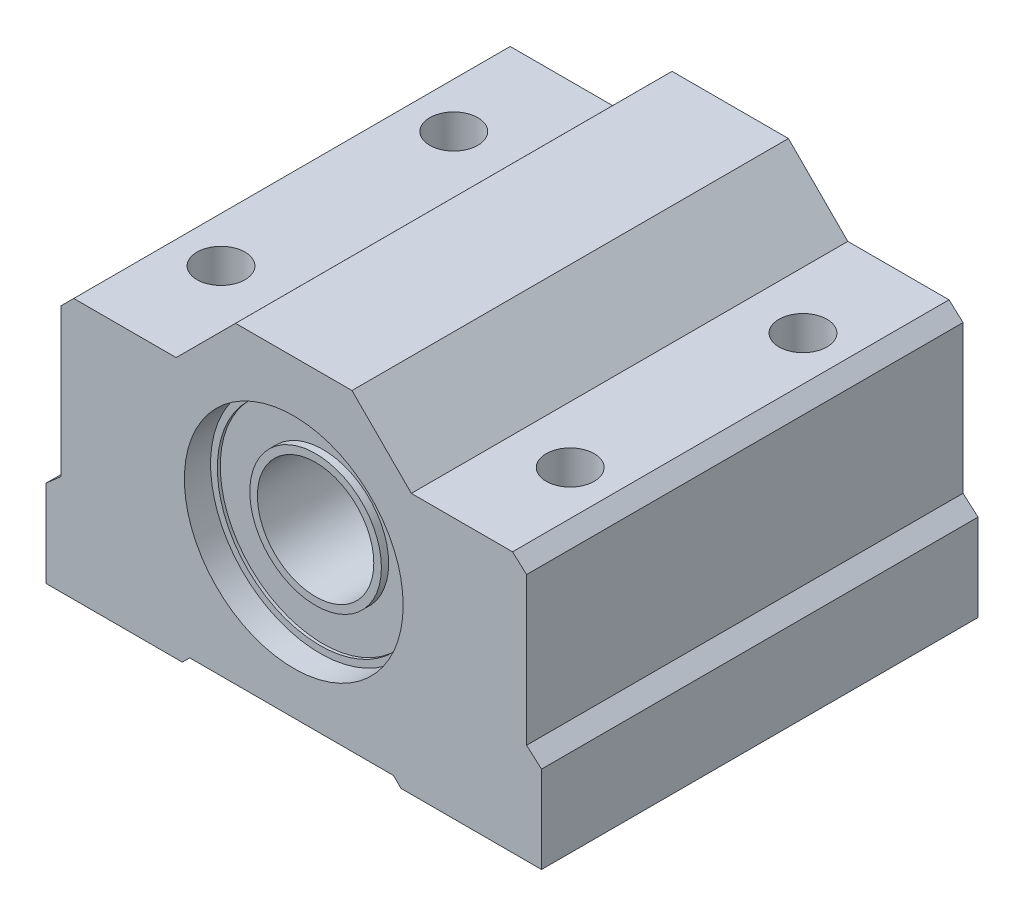
ISO-10303-21;
HEADER;
FILE_DESCRIPTION(('STEP AP214'),'2;1');
FILE_NAME('part.step','',(''),(''),'','','');
FILE_SCHEMA(('AUTOMOTIVE_DESIGN { 1 0 10303 214 1 1 1 1 }'));
ENDSEC;
DATA;
#1=APPLICATION_CONTEXT('core data for automotive mechanical design processes');
#2=APPLICATION_PROTOCOL_DEFINITION('international standard','automotive_design',2000,#1);
#3=PRODUCT_CONTEXT('',#1,'mechanical');
#4=PRODUCT('Part','Part','',(#3));
#5=PRODUCT_RELATED_PRODUCT_CATEGORY('part','',(#4));
#6=PRODUCT_DEFINITION_FORMATION('','',#4);
#7=PRODUCT_DEFINITION_CONTEXT('part definition',#1,'design');
#8=PRODUCT_DEFINITION('design','',#6,#7);
#9=PRODUCT_DEFINITION_SHAPE('','',#8);
#10=(LENGTH_UNIT() NAMED_UNIT(*) SI_UNIT(.MILLI.,.METRE.));
#11=(NAMED_UNIT(*) PLANE_ANGLE_UNIT() SI_UNIT($,.RADIAN.));
#12=(NAMED_UNIT(*) SI_UNIT($,.STERADIAN.) SOLID_ANGLE_UNIT());
#13=UNCERTAINTY_MEASURE_WITH_UNIT(LENGTH_MEASURE(1.E-05),#10,'distance_accuracy_value','');
#14=(GEOMETRIC_REPRESENTATION_CONTEXT(3) GLOBAL_UNCERTAINTY_ASSIGNED_CONTEXT((#13)) GLOBAL_UNIT_ASSIGNED_CONTEXT((#10,
#11,#12)) REPRESENTATION_CONTEXT('',''));
#15=CARTESIAN_POINT('',(0.,0.,0.));
#16=DIRECTION('',(0.,0.,1.));
#17=DIRECTION('',(1.,0.,0.));
#18=AXIS2_PLACEMENT_3D('',#15,#16,#17);
#19=CARTESIAN_POINT('',(0.,0.,-30.));
#20=DIRECTION('',(0.,0.,1.));
#21=DIRECTION('',(1.,0.,0.));
#22=AXIS2_PLACEMENT_3D('',#19,#20,#21);
#23=PLANE('',#22);
#24=DIRECTION('',(-0.748408560935745,-0.663237985882961,0.));
#25=VECTOR('',#24,1.);
#26=CARTESIAN_POINT('',(-5.00715940899254,5.65016034579369,-30.));
#27=LINE('',#26,#25);
#28=CARTESIAN_POINT('',(-15.9972160814821,-4.08920319527542,-30.));
#29=VERTEX_POINT('',#28);
#30=CARTESIAN_POINT('',(-17.03,-5.00445398438139,-30.));
#31=VERTEX_POINT('',#30);
#32=EDGE_CURVE('E253',#29,#31,#27,.T.);
#33=ORIENTED_EDGE('',*,*,#32,.F.);
#34=DIRECTION('',(0.,-1.,0.));
#35=VECTOR('',#34,1.);
#36=CARTESIAN_POINT('',(-15.9972160814821,0.,-30.));
#37=LINE('',#36,#35);
#38=CARTESIAN_POINT('',(-15.9972160814821,6.07141612040069,-30.));
#39=VERTEX_POINT('',#38);
#40=EDGE_CURVE('E191',#39,#29,#37,.T.);
#41=ORIENTED_EDGE('',*,*,#40,.F.);
#42=DIRECTION('',(-0.707106781186547,-0.707106781186548,0.));
#43=VECTOR('',#42,1.);
#44=CARTESIAN_POINT('',(-11.0343161009414,11.0343161009414,-30.));
#45=LINE('',#44,#43);
#46=CARTESIAN_POINT('',(-15.1243670871386,6.94426511474419,-30.));
#47=VERTEX_POINT('',#46);
#48=EDGE_CURVE('E176',#47,#39,#45,.T.);
#49=ORIENTED_EDGE('',*,*,#48,.F.);
#50=DIRECTION('',(-1.,0.,0.));
#51=VECTOR('',#50,1.);
#52=CARTESIAN_POINT('',(0.,6.9442651147442,-30.));
#53=LINE('',#52,#51);
#54=CARTESIAN_POINT('',(-8.083891516657,6.94426511474419,-30.));
#55=VERTEX_POINT('',#54);
#56=EDGE_CURVE('E189',#55,#47,#53,.T.);
#57=ORIENTED_EDGE('',*,*,#56,.F.);
#58=DIRECTION('',(-0.707276659522601,-0.706936862028393,0.));
#59=VECTOR('',#58,1.);
#60=CARTESIAN_POINT('',(-7.51213557308124,7.51574636915227,-30.));
#61=LINE('',#60,#59);
#62=CARTESIAN_POINT('',(-4.,11.0261946041163,-30.));
#63=VERTEX_POINT('',#62);
#64=EDGE_CURVE('E194',#63,#55,#61,.T.);
#65=ORIENTED_EDGE('',*,*,#64,.F.);
#66=DIRECTION('',(-1.,0.,0.));
#67=VECTOR('',#66,1.);
#68=CARTESIAN_POINT('',(0.,11.0261946041163,-30.));
#69=LINE('',#68,#67);
#70=CARTESIAN_POINT('',(4.,11.0261946041163,-30.));
#71=VERTEX_POINT('',#70);
#72=EDGE_CURVE('E196',#71,#63,#69,.T.);
#73=ORIENTED_EDGE('',*,*,#72,.F.);
#74=DIRECTION('',(-0.707106781186548,0.707106781186547,0.));
#75=VECTOR('',#74,1.);
#76=CARTESIAN_POINT('',(7.51309730205813,7.51309730205814,-30.));
#77=LINE('',#76,#75);
#78=CARTESIAN_POINT('',(8.0819294893721,6.94426511474417,-30.));
#79=VERTEX_POINT('',#78);
#80=EDGE_CURVE('E385',#79,#71,#77,.T.);
#81=ORIENTED_EDGE('',*,*,#80,.F.);
#82=DIRECTION('',(-1.,0.,0.));
#83=VECTOR('',#82,1.);
#84=CARTESIAN_POINT('',(0.,6.94426511474417,-30.));
#85=LINE('',#84,#83);
#86=CARTESIAN_POINT('',(15.0374546179448,6.94426511474418,-30.));
#87=VERTEX_POINT('',#86);
#88=EDGE_CURVE('E382',#87,#79,#85,.T.);
#89=ORIENTED_EDGE('',*,*,#88,.F.);
#90=DIRECTION('',(-0.741743771294362,0.670683366236272,0.));
#91=VECTOR('',#90,1.);
#92=CARTESIAN_POINT('',(10.2186901014741,11.301383208728,-30.));
#93=LINE('',#92,#91);
#94=CARTESIAN_POINT('',(16.0027839185179,6.07141612040066,-30.));
#95=VERTEX_POINT('',#94);
#96=EDGE_CURVE('E379',#95,#87,#93,.T.);
#97=ORIENTED_EDGE('',*,*,#96,.F.);
#98=DIRECTION('',(0.,1.,0.));
#99=VECTOR('',#98,1.);
#100=CARTESIAN_POINT('',(16.0027839185179,0.,-30.));
#101=LINE('',#100,#99);
#102=CARTESIAN_POINT('',(16.0027839185179,-4.08920319527547,-30.));
#103=VERTEX_POINT('',#102);
#104=EDGE_CURVE('E376',#103,#95,#101,.T.);
#105=ORIENTED_EDGE('',*,*,#104,.F.);
#106=DIRECTION('',(-0.749951735571776,0.661492550459097,0.));
#107=VECTOR('',#106,1.);
#108=CARTESIAN_POINT('',(4.97377394084638,5.63890008540626,-30.));
#109=LINE('',#108,#107);
#110=CARTESIAN_POINT('',(17.03,-4.99525588291164,-30.));
#111=VERTEX_POINT('',#110);
#112=EDGE_CURVE('E373',#111,#103,#109,.T.);
#113=ORIENTED_EDGE('',*,*,#112,.F.);
#114=DIRECTION('',(0.,1.,0.));
#115=VECTOR('',#114,1.);
#116=CARTESIAN_POINT('',(17.03,0.,-30.));
#117=LINE('',#116,#115);
#118=CARTESIAN_POINT('',(17.03,-10.9738053958837,-30.));
#119=VERTEX_POINT('',#118);
#120=EDGE_CURVE('E370',#119,#111,#117,.T.);
#121=ORIENTED_EDGE('',*,*,#120,.F.);
#122=DIRECTION('',(1.,0.,0.));
#123=VECTOR('',#122,1.);
#124=CARTESIAN_POINT('',(0.,-10.9738053958837,-30.));
#125=LINE('',#124,#123);
#126=CARTESIAN_POINT('',(7.36706184571891,-10.9738053958837,-30.));
#127=VERTEX_POINT('',#126);
#128=EDGE_CURVE('E367',#127,#119,#125,.T.);
#129=ORIENTED_EDGE('',*,*,#128,.F.);
#130=DIRECTION('',(0.707106781186548,-0.707106781186547,0.));
#131=VECTOR('',#130,1.);
#132=CARTESIAN_POINT('',(-1.80337177508242,-1.80337177508242,-30.));
#133=LINE('',#132,#131);
#134=CARTESIAN_POINT('',(6.85761623335725,-10.4643597835221,-30.));
#135=VERTEX_POINT('',#134);
#136=EDGE_CURVE('E364',#135,#127,#133,.T.);
#137=ORIENTED_EDGE('',*,*,#136,.F.);
#138=DIRECTION('',(1.,0.,0.));
#139=VECTOR('',#138,1.);
#140=CARTESIAN_POINT('',(0.,-10.4643597835221,-30.));
#141=LINE('',#140,#139);
#142=CARTESIAN_POINT('',(-7.15322917727557,-10.4643597835221,-30.));
#143=VERTEX_POINT('',#142);
#144=EDGE_CURVE('E361',#143,#135,#141,.T.);
#145=ORIENTED_EDGE('',*,*,#144,.F.);
#146=DIRECTION('',(0.707106781186549,0.707106781186546,0.));
#147=VECTOR('',#146,1.);
#148=CARTESIAN_POINT('',(1.65556530312327,-1.65556530312328,-30.));
#149=LINE('',#148,#147);
#150=CARTESIAN_POINT('',(-7.66267478963722,-10.9738053958837,-30.));
#151=VERTEX_POINT('',#150);
#152=EDGE_CURVE('E358',#151,#143,#149,.T.);
#153=ORIENTED_EDGE('',*,*,#152,.F.);
#154=DIRECTION('',(1.,0.,0.));
#155=VECTOR('',#154,1.);
#156=CARTESIAN_POINT('',(0.,-10.9738053958837,-30.));
#157=LINE('',#156,#155);
#158=CARTESIAN_POINT('',(-17.03,-10.9738053958837,-30.));
#159=VERTEX_POINT('',#158);
#160=EDGE_CURVE('E355',#159,#151,#157,.T.);
#161=ORIENTED_EDGE('',*,*,#160,.F.);
#162=DIRECTION('',(0.,-1.,0.));
#163=VECTOR('',#162,1.);
#164=CARTESIAN_POINT('',(-17.03,0.,-30.));
#165=LINE('',#164,#163);
#166=EDGE_CURVE('E353',#31,#159,#165,.T.);
#167=ORIENTED_EDGE('',*,*,#166,.F.);
#168=EDGE_LOOP('',(#33,#41,#49,#57,#65,#73,#81,#89,#97,#105,#113,#121,#129,#137,#145,#153,#161,#167));
#169=FACE_BOUND('',#168,.T.);
#170=CARTESIAN_POINT('',(0.,0.,-30.));
#171=DIRECTION('',(0.,0.,1.));
#172=DIRECTION('',(1.,0.,0.));
#173=AXIS2_PLACEMENT_3D('',#170,#171,#172);
#174=CIRCLE('',#173,7.51901731530374);
#175=CARTESIAN_POINT('',(7.51901731530374,0.,-30.));
#176=VERTEX_POINT('',#175);
#177=EDGE_CURVE('E328',#176,#176,#174,.T.);
#178=ORIENTED_EDGE('',*,*,#177,.T.);
#179=EDGE_LOOP('',(#178));
#180=FACE_BOUND('',#179,.T.);
#181=ADVANCED_FACE('F42',(#169,#180),#23,.F.);
#182=CARTESIAN_POINT('',(0.,0.,-2.));
#183=DIRECTION('',(0.,0.,1.));
#184=DIRECTION('',(1.,0.,0.));
#185=AXIS2_PLACEMENT_3D('',#182,#183,#184);
#186=CYLINDRICAL_SURFACE('',#185,7.0517883155918);
#187=CARTESIAN_POINT('',(0.,0.,-2.));
#188=DIRECTION('',(0.,0.,1.));
#189=DIRECTION('',(1.,0.,0.));
#190=AXIS2_PLACEMENT_3D('',#187,#188,#189);
#191=CIRCLE('',#190,7.0517883155918);
#192=CARTESIAN_POINT('',(7.0517883155918,0.,-2.));
#193=VERTEX_POINT('',#192);
#194=EDGE_CURVE('E335',#193,#193,#191,.T.);
#195=ORIENTED_EDGE('',*,*,#194,.F.);
#196=EDGE_LOOP('',(#195));
#197=FACE_BOUND('',#196,.T.);
#198=CARTESIAN_POINT('',(0.,0.,-1.8));
#199=DIRECTION('',(0.,0.,1.));
#200=DIRECTION('',(1.,0.,0.));
#201=AXIS2_PLACEMENT_3D('',#198,#199,#200);
#202=CIRCLE('',#201,7.0517883155918);
#203=CARTESIAN_POINT('',(7.0517883155918,0.,-1.8));
#204=VERTEX_POINT('',#203);
#205=EDGE_CURVE('E321',#204,#204,#202,.T.);
#206=ORIENTED_EDGE('',*,*,#205,.T.);
#207=EDGE_LOOP('',(#206));
#208=FACE_BOUND('',#207,.T.);
#209=ADVANCED_FACE('F297',(#197,#208),#186,.F.);
#210=CARTESIAN_POINT('',(0.,0.,-28.5));
#211=DIRECTION('',(0.,0.,1.));
#212=DIRECTION('',(1.,0.,0.));
#213=AXIS2_PLACEMENT_3D('',#210,#211,#212);
#214=CYLINDRICAL_SURFACE('',#213,4.);
#215=CARTESIAN_POINT('',(0.,0.,-28.5));
#216=DIRECTION('',(0.,0.,1.));
#217=DIRECTION('',(1.,0.,0.));
#218=AXIS2_PLACEMENT_3D('',#215,#216,#217);
#219=CIRCLE('',#218,4.);
#220=CARTESIAN_POINT('',(4.,0.,-28.5));
#221=VERTEX_POINT('',#220);
#222=EDGE_CURVE('E344',#221,#221,#219,.T.);
#223=ORIENTED_EDGE('',*,*,#222,.F.);
#224=EDGE_LOOP('',(#223));
#225=FACE_BOUND('',#224,.T.);
#226=CARTESIAN_POINT('',(0.,0.,-1.5));
#227=DIRECTION('',(0.,0.,1.));
#228=DIRECTION('',(1.,0.,0.));
#229=AXIS2_PLACEMENT_3D('',#226,#227,#228);
#230=CIRCLE('',#229,4.);
#231=CARTESIAN_POINT('',(4.,0.,-1.5));
#232=VERTEX_POINT('',#231);
#233=EDGE_CURVE('E341',#232,#232,#230,.T.);
#234=ORIENTED_EDGE('',*,*,#233,.T.);
#235=EDGE_LOOP('',(#234));
#236=FACE_BOUND('',#235,.T.);
#237=ADVANCED_FACE('F302',(#225,#236),#214,.F.);
#238=CARTESIAN_POINT('',(0.,0.,-30.));
#239=DIRECTION('',(0.,0.,1.));
#240=DIRECTION('',(1.,0.,0.));
#241=AXIS2_PLACEMENT_3D('',#238,#239,#240);
#242=CYLINDRICAL_SURFACE('',#241,7.0517883155918);
#243=CARTESIAN_POINT('',(0.,0.,-28.2));
#244=DIRECTION('',(0.,0.,1.));
#245=DIRECTION('',(1.,0.,0.));
#246=AXIS2_PLACEMENT_3D('',#243,#244,#245);
#247=CIRCLE('',#246,7.0517883155918);
#248=CARTESIAN_POINT('',(7.0517883155918,0.,-28.2));
#249=VERTEX_POINT('',#248);
#250=EDGE_CURVE('E485',#249,#249,#247,.T.);
#251=ORIENTED_EDGE('',*,*,#250,.F.);
#252=EDGE_LOOP('',(#251));
#253=FACE_BOUND('',#252,.T.);
#254=CARTESIAN_POINT('',(0.,0.,-28.));
#255=DIRECTION('',(0.,0.,1.));
#256=DIRECTION('',(1.,0.,0.));
#257=AXIS2_PLACEMENT_3D('',#254,#255,#256);
#258=CIRCLE('',#257,7.0517883155918);
#259=CARTESIAN_POINT('',(7.0517883155918,0.,-28.));
#260=VERTEX_POINT('',#259);
#261=EDGE_CURVE('E12',#260,#260,#258,.F.);
#262=ORIENTED_EDGE('',*,*,#261,.F.);
#263=EDGE_LOOP('',(#262));
#264=FACE_BOUND('',#263,.T.);
#265=ADVANCED_FACE('F294',(#253,#264),#242,.F.);
#266=CARTESIAN_POINT('',(-5.00715940899254,5.65016034579369,-30.));
#267=DIRECTION('',(-0.663237985882961,0.748408560935745,0.));
#268=DIRECTION('',(-0.748408560935745,-0.663237985882961,0.));
#269=AXIS2_PLACEMENT_3D('',#266,#267,#268);
#270=PLANE('',#269);
#271=DIRECTION('',(-0.748408560935745,-0.663237985882961,0.));
#272=VECTOR('',#271,1.);
#273=CARTESIAN_POINT('',(-5.00715940899254,5.65016034579369,0.));
#274=LINE('',#273,#272);
#275=CARTESIAN_POINT('',(-15.9972160814821,-4.08920319527542,0.));
#276=VERTEX_POINT('',#275);
#277=CARTESIAN_POINT('',(-17.03,-5.00445398438139,0.));
#278=VERTEX_POINT('',#277);
#279=EDGE_CURVE('E201',#276,#278,#274,.T.);
#280=ORIENTED_EDGE('',*,*,#279,.F.);
#281=DIRECTION('',(0.,0.,1.));
#282=VECTOR('',#281,1.);
#283=CARTESIAN_POINT('',(-15.9972160814821,-4.08920319527542,-30.));
#284=LINE('',#283,#282);
#285=EDGE_CURVE('E51',#29,#276,#284,.T.);
#286=ORIENTED_EDGE('',*,*,#285,.F.);
#287=ORIENTED_EDGE('',*,*,#32,.T.);
#288=DIRECTION('',(0.,0.,1.));
#289=VECTOR('',#288,1.);
#290=CARTESIAN_POINT('',(-17.03,-5.00445398438139,-30.));
#291=LINE('',#290,#289);
#292=EDGE_CURVE('E129',#31,#278,#291,.T.);
#293=ORIENTED_EDGE('',*,*,#292,.T.);
#294=EDGE_LOOP('',(#280,#286,#287,#293));
#295=FACE_BOUND('',#294,.T.);
#296=ADVANCED_FACE('F44',(#295),#270,.T.);
#297=CARTESIAN_POINT('',(-15.9972160814821,0.,-30.));
#298=DIRECTION('',(-1.,0.,0.));
#299=DIRECTION('',(0.,0.,1.));
#300=AXIS2_PLACEMENT_3D('',#297,#298,#299);
#301=PLANE('',#300);
#302=DIRECTION('',(0.,-1.,0.));
#303=VECTOR('',#302,1.);
#304=CARTESIAN_POINT('',(-15.9972160814821,0.,0.));
#305=LINE('',#304,#303);
#306=CARTESIAN_POINT('',(-15.9972160814821,6.07141612040069,0.));
#307=VERTEX_POINT('',#306);
#308=EDGE_CURVE('E250',#307,#276,#305,.T.);
#309=ORIENTED_EDGE('',*,*,#308,.F.);
#310=DIRECTION('',(0.,0.,1.));
#311=VECTOR('',#310,1.);
#312=CARTESIAN_POINT('',(-15.9972160814821,6.07141612040069,-30.));
#313=LINE('',#312,#311);
#314=EDGE_CURVE('E117',#39,#307,#313,.T.);
#315=ORIENTED_EDGE('',*,*,#314,.F.);
#316=ORIENTED_EDGE('',*,*,#40,.T.);
#317=ORIENTED_EDGE('',*,*,#285,.T.);
#318=EDGE_LOOP('',(#309,#315,#316,#317));
#319=FACE_BOUND('',#318,.T.);
#320=ADVANCED_FACE('F286',(#319),#301,.T.);
#321=CARTESIAN_POINT('',(-11.0343161009414,11.0343161009414,-30.));
#322=DIRECTION('',(-0.707106781186548,0.707106781186547,0.));
#323=DIRECTION('',(-0.707106781186547,-0.707106781186548,0.));
#324=AXIS2_PLACEMENT_3D('',#321,#322,#323);
#325=PLANE('',#324);
#326=DIRECTION('',(-0.707106781186547,-0.707106781186548,0.));
#327=VECTOR('',#326,1.);
#328=CARTESIAN_POINT('',(-11.0343161009414,11.0343161009414,0.));
#329=LINE('',#328,#327);
#330=CARTESIAN_POINT('',(-15.1243670871386,6.94426511474419,0.));
#331=VERTEX_POINT('',#330);
#332=EDGE_CURVE('E178',#331,#307,#329,.T.);
#333=ORIENTED_EDGE('',*,*,#332,.F.);
#334=DIRECTION('',(0.,0.,1.));
#335=VECTOR('',#334,1.);
#336=CARTESIAN_POINT('',(-15.1243670871386,6.94426511474419,-30.));
#337=LINE('',#336,#335);
#338=EDGE_CURVE('E173',#47,#331,#337,.T.);
#339=ORIENTED_EDGE('',*,*,#338,.F.);
#340=ORIENTED_EDGE('',*,*,#48,.T.);
#341=ORIENTED_EDGE('',*,*,#314,.T.);
#342=EDGE_LOOP('',(#333,#339,#340,#341));
#343=FACE_BOUND('',#342,.T.);
#344=ADVANCED_FACE('F175',(#343),#325,.T.);
#345=CARTESIAN_POINT('',(0.,6.9442651147442,-30.));
#346=DIRECTION('',(0.,1.,0.));
#347=DIRECTION('',(-1.,0.,0.));
#348=AXIS2_PLACEMENT_3D('',#345,#346,#347);
#349=PLANE('',#348);
#350=CARTESIAN_POINT('',(-12.,6.94426511474419,-23.));
#351=DIRECTION('',(0.,1.,0.));
#352=DIRECTION('',(-1.,0.,0.));
#353=AXIS2_PLACEMENT_3D('',#350,#351,#352);
#354=CIRCLE('',#353,1.65);
#355=CARTESIAN_POINT('',(-13.65,6.94426511474419,-23.));
#356=VERTEX_POINT('',#355);
#357=EDGE_CURVE('E786',#356,#356,#354,.T.);
#358=ORIENTED_EDGE('',*,*,#357,.F.);
#359=EDGE_LOOP('',(#358));
#360=FACE_BOUND('',#359,.T.);
#361=CARTESIAN_POINT('',(-12.,6.94426511474419,-7.));
#362=DIRECTION('',(0.,1.,0.));
#363=DIRECTION('',(-1.,0.,0.));
#364=AXIS2_PLACEMENT_3D('',#361,#362,#363);
#365=CIRCLE('',#364,1.65);
#366=CARTESIAN_POINT('',(-13.65,6.94426511474419,-7.));
#367=VERTEX_POINT('',#366);
#368=EDGE_CURVE('E481',#367,#367,#365,.T.);
#369=ORIENTED_EDGE('',*,*,#368,.F.);
#370=EDGE_LOOP('',(#369));
#371=FACE_BOUND('',#370,.T.);
#372=DIRECTION('',(-1.,0.,0.));
#373=VECTOR('',#372,1.);
#374=CARTESIAN_POINT('',(0.,6.9442651147442,0.));
#375=LINE('',#374,#373);
#376=CARTESIAN_POINT('',(-8.083891516657,6.94426511474419,0.));
#377=VERTEX_POINT('',#376);
#378=EDGE_CURVE('E247',#377,#331,#375,.T.);
#379=ORIENTED_EDGE('',*,*,#378,.F.);
#380=DIRECTION('',(0.,0.,1.));
#381=VECTOR('',#380,1.);
#382=CARTESIAN_POINT('',(-8.083891516657,6.94426511474419,-30.));
#383=LINE('',#382,#381);
#384=EDGE_CURVE('E183',#55,#377,#383,.T.);
#385=ORIENTED_EDGE('',*,*,#384,.F.);
#386=ORIENTED_EDGE('',*,*,#56,.T.);
#387=ORIENTED_EDGE('',*,*,#338,.T.);
#388=EDGE_LOOP('',(#379,#385,#386,#387));
#389=FACE_BOUND('',#388,.T.);
#390=ADVANCED_FACE('F193',(#360,#371,#389),#349,.T.);
#391=CARTESIAN_POINT('',(-7.51213557308124,7.51574636915227,-30.));
#392=DIRECTION('',(-0.706936862028393,0.707276659522601,0.));
#393=DIRECTION('',(-0.707276659522601,-0.706936862028393,0.));
#394=AXIS2_PLACEMENT_3D('',#391,#392,#393);
#395=PLANE('',#394);
#396=DIRECTION('',(-0.707276659522601,-0.706936862028393,0.));
#397=VECTOR('',#396,1.);
#398=CARTESIAN_POINT('',(-7.51213557308124,7.51574636915227,0.));
#399=LINE('',#398,#397);
#400=CARTESIAN_POINT('',(-4.,11.0261946041163,0.));
#401=VERTEX_POINT('',#400);
#402=EDGE_CURVE('E244',#401,#377,#399,.T.);
#403=ORIENTED_EDGE('',*,*,#402,.F.);
#404=DIRECTION('',(0.,0.,1.));
#405=VECTOR('',#404,1.);
#406=CARTESIAN_POINT('',(-4.,11.0261946041163,-30.));
#407=LINE('',#406,#405);
#408=EDGE_CURVE('E257',#63,#401,#407,.T.);
#409=ORIENTED_EDGE('',*,*,#408,.F.);
#410=ORIENTED_EDGE('',*,*,#64,.T.);
#411=ORIENTED_EDGE('',*,*,#384,.T.);
#412=EDGE_LOOP('',(#403,#409,#410,#411));
#413=FACE_BOUND('',#412,.T.);
#414=ADVANCED_FACE('F436',(#413),#395,.T.);
#415=CARTESIAN_POINT('',(0.,11.0261946041163,-30.));
#416=DIRECTION('',(0.,1.,0.));
#417=DIRECTION('',(-1.,0.,0.));
#418=AXIS2_PLACEMENT_3D('',#415,#416,#417);
#419=PLANE('',#418);
#420=DIRECTION('',(-1.,0.,0.));
#421=VECTOR('',#420,1.);
#422=CARTESIAN_POINT('',(0.,11.0261946041163,0.));
#423=LINE('',#422,#421);
#424=CARTESIAN_POINT('',(4.,11.0261946041163,0.));
#425=VERTEX_POINT('',#424);
#426=EDGE_CURVE('E241',#425,#401,#423,.T.);
#427=ORIENTED_EDGE('',*,*,#426,.F.);
#428=DIRECTION('',(0.,0.,1.));
#429=VECTOR('',#428,1.);
#430=CARTESIAN_POINT('',(4.,11.0261946041163,-30.));
#431=LINE('',#430,#429);
#432=EDGE_CURVE('E259',#71,#425,#431,.T.);
#433=ORIENTED_EDGE('',*,*,#432,.F.);
#434=ORIENTED_EDGE('',*,*,#72,.T.);
#435=ORIENTED_EDGE('',*,*,#408,.T.);
#436=EDGE_LOOP('',(#427,#433,#434,#435));
#437=FACE_BOUND('',#436,.T.);
#438=ADVANCED_FACE('F391',(#437),#419,.T.);
#439=CARTESIAN_POINT('',(7.51309730205813,7.51309730205814,-30.));
#440=DIRECTION('',(0.707106781186547,0.707106781186548,0.));
#441=DIRECTION('',(-0.707106781186548,0.707106781186547,0.));
#442=AXIS2_PLACEMENT_3D('',#439,#440,#441);
#443=PLANE('',#442);
#444=DIRECTION('',(-0.707106781186548,0.707106781186547,0.));
#445=VECTOR('',#444,1.);
#446=CARTESIAN_POINT('',(7.51309730205813,7.51309730205814,0.));
#447=LINE('',#446,#445);
#448=CARTESIAN_POINT('',(8.0819294893721,6.94426511474417,0.));
#449=VERTEX_POINT('',#448);
#450=EDGE_CURVE('E238',#449,#425,#447,.T.);
#451=ORIENTED_EDGE('',*,*,#450,.F.);
#452=DIRECTION('',(0.,0.,1.));
#453=VECTOR('',#452,1.);
#454=CARTESIAN_POINT('',(8.0819294893721,6.94426511474417,-30.));
#455=LINE('',#454,#453);
#456=EDGE_CURVE('E261',#79,#449,#455,.T.);
#457=ORIENTED_EDGE('',*,*,#456,.F.);
#458=ORIENTED_EDGE('',*,*,#80,.T.);
#459=ORIENTED_EDGE('',*,*,#432,.T.);
#460=EDGE_LOOP('',(#451,#457,#458,#459));
#461=FACE_BOUND('',#460,.T.);
#462=ADVANCED_FACE('F397',(#461),#443,.T.);
#463=CARTESIAN_POINT('',(0.,6.94426511474417,-30.));
#464=DIRECTION('',(0.,1.,0.));
#465=DIRECTION('',(-1.,0.,0.));
#466=AXIS2_PLACEMENT_3D('',#463,#464,#465);
#467=PLANE('',#466);
#468=CARTESIAN_POINT('',(12.,6.94426511474417,-23.));
#469=DIRECTION('',(0.,1.,0.));
#470=DIRECTION('',(-1.,0.,0.));
#471=AXIS2_PLACEMENT_3D('',#468,#469,#470);
#472=CIRCLE('',#471,1.65);
#473=CARTESIAN_POINT('',(10.35,6.94426511474417,-23.));
#474=VERTEX_POINT('',#473);
#475=EDGE_CURVE('E793',#474,#474,#472,.T.);
#476=ORIENTED_EDGE('',*,*,#475,.F.);
#477=EDGE_LOOP('',(#476));
#478=FACE_BOUND('',#477,.T.);
#479=CARTESIAN_POINT('',(12.,6.94426511474417,-7.));
#480=DIRECTION('',(0.,1.,0.));
#481=DIRECTION('',(-1.,0.,0.));
#482=AXIS2_PLACEMENT_3D('',#479,#480,#481);
#483=CIRCLE('',#482,1.65);
#484=CARTESIAN_POINT('',(10.35,6.94426511474417,-7.));
#485=VERTEX_POINT('',#484);
#486=EDGE_CURVE('E482',#485,#485,#483,.T.);
#487=ORIENTED_EDGE('',*,*,#486,.F.);
#488=EDGE_LOOP('',(#487));
#489=FACE_BOUND('',#488,.T.);
#490=DIRECTION('',(-1.,0.,0.));
#491=VECTOR('',#490,1.);
#492=CARTESIAN_POINT('',(0.,6.94426511474417,0.));
#493=LINE('',#492,#491);
#494=CARTESIAN_POINT('',(15.0374546179448,6.94426511474418,0.));
#495=VERTEX_POINT('',#494);
#496=EDGE_CURVE('E235',#495,#449,#493,.T.);
#497=ORIENTED_EDGE('',*,*,#496,.F.);
#498=DIRECTION('',(0.,0.,1.));
#499=VECTOR('',#498,1.);
#500=CARTESIAN_POINT('',(15.0374546179448,6.94426511474418,-30.));
#501=LINE('',#500,#499);
#502=EDGE_CURVE('E263',#87,#495,#501,.T.);
#503=ORIENTED_EDGE('',*,*,#502,.F.);
#504=ORIENTED_EDGE('',*,*,#88,.T.);
#505=ORIENTED_EDGE('',*,*,#456,.T.);
#506=EDGE_LOOP('',(#497,#503,#504,#505));
#507=FACE_BOUND('',#506,.T.);
#508=ADVANCED_FACE('F400',(#478,#489,#507),#467,.T.);
#509=CARTESIAN_POINT('',(10.2186901014741,11.301383208728,-30.));
#510=DIRECTION('',(0.670683366236272,0.741743771294362,0.));
#511=DIRECTION('',(-0.741743771294362,0.670683366236272,0.));
#512=AXIS2_PLACEMENT_3D('',#509,#510,#511);
#513=PLANE('',#512);
#514=DIRECTION('',(-0.741743771294362,0.670683366236272,0.));
#515=VECTOR('',#514,1.);
#516=CARTESIAN_POINT('',(10.2186901014741,11.301383208728,0.));
#517=LINE('',#516,#515);
#518=CARTESIAN_POINT('',(16.0027839185179,6.07141612040066,0.));
#519=VERTEX_POINT('',#518);
#520=EDGE_CURVE('E232',#519,#495,#517,.T.);
#521=ORIENTED_EDGE('',*,*,#520,.F.);
#522=DIRECTION('',(0.,0.,1.));
#523=VECTOR('',#522,1.);
#524=CARTESIAN_POINT('',(16.0027839185179,6.07141612040066,-30.));
#525=LINE('',#524,#523);
#526=EDGE_CURVE('E265',#95,#519,#525,.T.);
#527=ORIENTED_EDGE('',*,*,#526,.F.);
#528=ORIENTED_EDGE('',*,*,#96,.T.);
#529=ORIENTED_EDGE('',*,*,#502,.T.);
#530=EDGE_LOOP('',(#521,#527,#528,#529));
#531=FACE_BOUND('',#530,.T.);
#532=ADVANCED_FACE('F405',(#531),#513,.T.);
#533=CARTESIAN_POINT('',(16.0027839185179,0.,-30.));
#534=DIRECTION('',(1.,0.,0.));
#535=DIRECTION('',(0.,0.,-1.));
#536=AXIS2_PLACEMENT_3D('',#533,#534,#535);
#537=PLANE('',#536);
#538=DIRECTION('',(0.,1.,0.));
#539=VECTOR('',#538,1.);
#540=CARTESIAN_POINT('',(16.0027839185179,0.,0.));
#541=LINE('',#540,#539);
#542=CARTESIAN_POINT('',(16.0027839185179,-4.08920319527547,0.));
#543=VERTEX_POINT('',#542);
#544=EDGE_CURVE('E229',#543,#519,#541,.T.);
#545=ORIENTED_EDGE('',*,*,#544,.F.);
#546=DIRECTION('',(0.,0.,1.));
#547=VECTOR('',#546,1.);
#548=CARTESIAN_POINT('',(16.0027839185179,-4.08920319527547,-30.));
#549=LINE('',#548,#547);
#550=EDGE_CURVE('E267',#103,#543,#549,.T.);
#551=ORIENTED_EDGE('',*,*,#550,.F.);
#552=ORIENTED_EDGE('',*,*,#104,.T.);
#553=ORIENTED_EDGE('',*,*,#526,.T.);
#554=EDGE_LOOP('',(#545,#551,#552,#553));
#555=FACE_BOUND('',#554,.T.);
#556=ADVANCED_FACE('F408',(#555),#537,.T.);
#557=CARTESIAN_POINT('',(4.97377394084638,5.63890008540626,-30.));
#558=DIRECTION('',(0.661492550459097,0.749951735571776,0.));
#559=DIRECTION('',(-0.749951735571776,0.661492550459097,0.));
#560=AXIS2_PLACEMENT_3D('',#557,#558,#559);
#561=PLANE('',#560);
#562=DIRECTION('',(-0.749951735571776,0.661492550459097,0.));
#563=VECTOR('',#562,1.);
#564=CARTESIAN_POINT('',(4.97377394084638,5.63890008540626,0.));
#565=LINE('',#564,#563);
#566=CARTESIAN_POINT('',(17.03,-4.99525588291164,0.));
#567=VERTEX_POINT('',#566);
#568=EDGE_CURVE('E226',#567,#543,#565,.T.);
#569=ORIENTED_EDGE('',*,*,#568,.F.);
#570=DIRECTION('',(0.,0.,1.));
#571=VECTOR('',#570,1.);
#572=CARTESIAN_POINT('',(17.03,-4.99525588291164,-30.));
#573=LINE('',#572,#571);
#574=EDGE_CURVE('E269',#111,#567,#573,.T.);
#575=ORIENTED_EDGE('',*,*,#574,.F.);
#576=ORIENTED_EDGE('',*,*,#112,.T.);
#577=ORIENTED_EDGE('',*,*,#550,.T.);
#578=EDGE_LOOP('',(#569,#575,#576,#577));
#579=FACE_BOUND('',#578,.T.);
#580=ADVANCED_FACE('F413',(#579),#561,.T.);
#581=CARTESIAN_POINT('',(17.03,0.,-30.));
#582=DIRECTION('',(1.,0.,0.));
#583=DIRECTION('',(0.,0.,-1.));
#584=AXIS2_PLACEMENT_3D('',#581,#582,#583);
#585=PLANE('',#584);
#586=DIRECTION('',(0.,1.,0.));
#587=VECTOR('',#586,1.);
#588=CARTESIAN_POINT('',(17.03,0.,0.));
#589=LINE('',#588,#587);
#590=CARTESIAN_POINT('',(17.03,-10.9738053958837,0.));
#591=VERTEX_POINT('',#590);
#592=EDGE_CURVE('E223',#591,#567,#589,.T.);
#593=ORIENTED_EDGE('',*,*,#592,.F.);
#594=DIRECTION('',(0.,0.,1.));
#595=VECTOR('',#594,1.);
#596=CARTESIAN_POINT('',(17.03,-10.9738053958837,-30.));
#597=LINE('',#596,#595);
#598=EDGE_CURVE('E271',#119,#591,#597,.T.);
#599=ORIENTED_EDGE('',*,*,#598,.F.);
#600=ORIENTED_EDGE('',*,*,#120,.T.);
#601=ORIENTED_EDGE('',*,*,#574,.T.);
#602=EDGE_LOOP('',(#593,#599,#600,#601));
#603=FACE_BOUND('',#602,.T.);
#604=ADVANCED_FACE('F416',(#603),#585,.T.);
#605=CARTESIAN_POINT('',(0.,-10.9738053958837,-30.));
#606=DIRECTION('',(0.,-1.,0.));
#607=DIRECTION('',(0.,0.,-1.));
#608=AXIS2_PLACEMENT_3D('',#605,#606,#607);
#609=PLANE('',#608);
#610=CARTESIAN_POINT('',(12.,-10.9738053958837,-23.));
#611=DIRECTION('',(0.,-1.,0.));
#612=DIRECTION('',(1.,0.,0.));
#613=AXIS2_PLACEMENT_3D('',#610,#611,#612);
#614=CIRCLE('',#613,1.65);
#615=CARTESIAN_POINT('',(13.65,-10.9738053958837,-23.));
#616=VERTEX_POINT('',#615);
#617=EDGE_CURVE('E788',#616,#616,#614,.T.);
#618=ORIENTED_EDGE('',*,*,#617,.F.);
#619=EDGE_LOOP('',(#618));
#620=FACE_BOUND('',#619,.T.);
#621=CARTESIAN_POINT('',(12.,-10.9738053958837,-7.));
#622=DIRECTION('',(0.,-1.,0.));
#623=DIRECTION('',(1.,0.,0.));
#624=AXIS2_PLACEMENT_3D('',#621,#622,#623);
#625=CIRCLE('',#624,1.65);
#626=CARTESIAN_POINT('',(13.65,-10.9738053958837,-7.));
#627=VERTEX_POINT('',#626);
#628=EDGE_CURVE('E488',#627,#627,#625,.T.);
#629=ORIENTED_EDGE('',*,*,#628,.F.);
#630=EDGE_LOOP('',(#629));
#631=FACE_BOUND('',#630,.T.);
#632=DIRECTION('',(1.,0.,0.));
#633=VECTOR('',#632,1.);
#634=CARTESIAN_POINT('',(0.,-10.9738053958837,0.));
#635=LINE('',#634,#633);
#636=CARTESIAN_POINT('',(7.36706184571891,-10.9738053958837,0.));
#637=VERTEX_POINT('',#636);
#638=EDGE_CURVE('E220',#637,#591,#635,.T.);
#639=ORIENTED_EDGE('',*,*,#638,.F.);
#640=DIRECTION('',(0.,0.,1.));
#641=VECTOR('',#640,1.);
#642=CARTESIAN_POINT('',(7.36706184571891,-10.9738053958837,-30.));
#643=LINE('',#642,#641);
#644=EDGE_CURVE('E273',#127,#637,#643,.T.);
#645=ORIENTED_EDGE('',*,*,#644,.F.);
#646=ORIENTED_EDGE('',*,*,#128,.T.);
#647=ORIENTED_EDGE('',*,*,#598,.T.);
#648=EDGE_LOOP('',(#639,#645,#646,#647));
#649=FACE_BOUND('',#648,.T.);
#650=ADVANCED_FACE('F421',(#620,#631,#649),#609,.T.);
#651=CARTESIAN_POINT('',(-1.80337177508242,-1.80337177508242,-30.));
#652=DIRECTION('',(-0.707106781186547,-0.707106781186548,0.));
#653=DIRECTION('',(0.707106781186548,-0.707106781186547,0.));
#654=AXIS2_PLACEMENT_3D('',#651,#652,#653);
#655=PLANE('',#654);
#656=DIRECTION('',(0.707106781186548,-0.707106781186547,0.));
#657=VECTOR('',#656,1.);
#658=CARTESIAN_POINT('',(-1.80337177508242,-1.80337177508242,0.));
#659=LINE('',#658,#657);
#660=CARTESIAN_POINT('',(6.85761623335725,-10.4643597835221,0.));
#661=VERTEX_POINT('',#660);
#662=EDGE_CURVE('E217',#661,#637,#659,.T.);
#663=ORIENTED_EDGE('',*,*,#662,.F.);
#664=DIRECTION('',(0.,0.,1.));
#665=VECTOR('',#664,1.);
#666=CARTESIAN_POINT('',(6.85761623335725,-10.4643597835221,-30.));
#667=LINE('',#666,#665);
#668=EDGE_CURVE('E275',#135,#661,#667,.T.);
#669=ORIENTED_EDGE('',*,*,#668,.F.);
#670=ORIENTED_EDGE('',*,*,#136,.T.);
#671=ORIENTED_EDGE('',*,*,#644,.T.);
#672=EDGE_LOOP('',(#663,#669,#670,#671));
#673=FACE_BOUND('',#672,.T.);
#674=ADVANCED_FACE('F424',(#673),#655,.T.);
#675=CARTESIAN_POINT('',(0.,-10.4643597835221,-30.));
#676=DIRECTION('',(0.,-1.,0.));
#677=DIRECTION('',(0.,0.,-1.));
#678=AXIS2_PLACEMENT_3D('',#675,#676,#677);
#679=PLANE('',#678);
#680=DIRECTION('',(1.,0.,0.));
#681=VECTOR('',#680,1.);
#682=CARTESIAN_POINT('',(0.,-10.4643597835221,0.));
#683=LINE('',#682,#681);
#684=CARTESIAN_POINT('',(-7.15322917727557,-10.4643597835221,0.));
#685=VERTEX_POINT('',#684);
#686=EDGE_CURVE('E214',#685,#661,#683,.T.);
#687=ORIENTED_EDGE('',*,*,#686,.F.);
#688=DIRECTION('',(0.,0.,1.));
#689=VECTOR('',#688,1.);
#690=CARTESIAN_POINT('',(-7.15322917727557,-10.4643597835221,-30.));
#691=LINE('',#690,#689);
#692=EDGE_CURVE('E277',#143,#685,#691,.T.);
#693=ORIENTED_EDGE('',*,*,#692,.F.);
#694=ORIENTED_EDGE('',*,*,#144,.T.);
#695=ORIENTED_EDGE('',*,*,#668,.T.);
#696=EDGE_LOOP('',(#687,#693,#694,#695));
#697=FACE_BOUND('',#696,.T.);
#698=ADVANCED_FACE('F429',(#697),#679,.T.);
#699=CARTESIAN_POINT('',(1.65556530312327,-1.65556530312328,-30.));
#700=DIRECTION('',(0.707106781186546,-0.707106781186549,0.));
#701=DIRECTION('',(0.707106781186549,0.707106781186546,0.));
#702=AXIS2_PLACEMENT_3D('',#699,#700,#701);
#703=PLANE('',#702);
#704=DIRECTION('',(0.707106781186549,0.707106781186546,0.));
#705=VECTOR('',#704,1.);
#706=CARTESIAN_POINT('',(1.65556530312327,-1.65556530312328,0.));
#707=LINE('',#706,#705);
#708=CARTESIAN_POINT('',(-7.66267478963722,-10.9738053958837,0.));
#709=VERTEX_POINT('',#708);
#710=EDGE_CURVE('E211',#709,#685,#707,.T.);
#711=ORIENTED_EDGE('',*,*,#710,.F.);
#712=DIRECTION('',(0.,0.,1.));
#713=VECTOR('',#712,1.);
#714=CARTESIAN_POINT('',(-7.66267478963722,-10.9738053958837,-30.));
#715=LINE('',#714,#713);
#716=EDGE_CURVE('E279',#151,#709,#715,.T.);
#717=ORIENTED_EDGE('',*,*,#716,.F.);
#718=ORIENTED_EDGE('',*,*,#152,.T.);
#719=ORIENTED_EDGE('',*,*,#692,.T.);
#720=EDGE_LOOP('',(#711,#717,#718,#719));
#721=FACE_BOUND('',#720,.T.);
#722=ADVANCED_FACE('F432',(#721),#703,.T.);
#723=CARTESIAN_POINT('',(0.,-10.9738053958837,-30.));
#724=DIRECTION('',(0.,-1.,0.));
#725=DIRECTION('',(1.,0.,0.));
#726=AXIS2_PLACEMENT_3D('',#723,#724,#725);
#727=PLANE('',#726);
#728=CARTESIAN_POINT('',(-12.,-10.9738053958837,-23.));
#729=DIRECTION('',(0.,-1.,0.));
#730=DIRECTION('',(1.,0.,0.));
#731=AXIS2_PLACEMENT_3D('',#728,#729,#730);
#732=CIRCLE('',#731,1.65);
#733=CARTESIAN_POINT('',(-10.35,-10.9738053958837,-23.));
#734=VERTEX_POINT('',#733);
#735=EDGE_CURVE('E476',#734,#734,#732,.T.);
#736=ORIENTED_EDGE('',*,*,#735,.F.);
#737=EDGE_LOOP('',(#736));
#738=FACE_BOUND('',#737,.T.);
#739=CARTESIAN_POINT('',(-12.,-10.9738053958837,-7.));
#740=DIRECTION('',(0.,-1.,0.));
#741=DIRECTION('',(1.,0.,0.));
#742=AXIS2_PLACEMENT_3D('',#739,#740,#741);
#743=CIRCLE('',#742,1.65);
#744=CARTESIAN_POINT('',(-10.35,-10.9738053958837,-7.));
#745=VERTEX_POINT('',#744);
#746=EDGE_CURVE('E479',#745,#745,#743,.T.);
#747=ORIENTED_EDGE('',*,*,#746,.F.);
#748=EDGE_LOOP('',(#747));
#749=FACE_BOUND('',#748,.T.);
#750=DIRECTION('',(1.,0.,0.));
#751=VECTOR('',#750,1.);
#752=CARTESIAN_POINT('',(0.,-10.9738053958837,0.));
#753=LINE('',#752,#751);
#754=CARTESIAN_POINT('',(-17.03,-10.9738053958837,0.));
#755=VERTEX_POINT('',#754);
#756=EDGE_CURVE('E208',#755,#709,#753,.T.);
#757=ORIENTED_EDGE('',*,*,#756,.F.);
#758=DIRECTION('',(0.,0.,1.));
#759=VECTOR('',#758,1.);
#760=CARTESIAN_POINT('',(-17.03,-10.9738053958837,-30.));
#761=LINE('',#760,#759);
#762=EDGE_CURVE('E281',#159,#755,#761,.T.);
#763=ORIENTED_EDGE('',*,*,#762,.F.);
#764=ORIENTED_EDGE('',*,*,#160,.T.);
#765=ORIENTED_EDGE('',*,*,#716,.T.);
#766=EDGE_LOOP('',(#757,#763,#764,#765));
#767=FACE_BOUND('',#766,.T.);
#768=ADVANCED_FACE('F316',(#738,#749,#767),#727,.T.);
#769=CARTESIAN_POINT('',(-17.03,0.,-30.));
#770=DIRECTION('',(-1.,0.,0.));
#771=DIRECTION('',(0.,0.,1.));
#772=AXIS2_PLACEMENT_3D('',#769,#770,#771);
#773=PLANE('',#772);
#774=DIRECTION('',(0.,-1.,0.));
#775=VECTOR('',#774,1.);
#776=CARTESIAN_POINT('',(-17.03,0.,0.));
#777=LINE('',#776,#775);
#778=EDGE_CURVE('E204',#278,#755,#777,.T.);
#779=ORIENTED_EDGE('',*,*,#778,.F.);
#780=ORIENTED_EDGE('',*,*,#292,.F.);
#781=ORIENTED_EDGE('',*,*,#166,.T.);
#782=ORIENTED_EDGE('',*,*,#762,.T.);
#783=EDGE_LOOP('',(#779,#780,#781,#782));
#784=FACE_BOUND('',#783,.T.);
#785=ADVANCED_FACE('F282',(#784),#773,.T.);
#786=CARTESIAN_POINT('',(0.,0.,0.));
#787=DIRECTION('',(0.,0.,1.));
#788=DIRECTION('',(1.,0.,0.));
#789=AXIS2_PLACEMENT_3D('',#786,#787,#788);
#790=PLANE('',#789);
#791=CARTESIAN_POINT('',(0.,0.,0.));
#792=DIRECTION('',(0.,0.,1.));
#793=DIRECTION('',(1.,0.,0.));
#794=AXIS2_PLACEMENT_3D('',#791,#792,#793);
#795=CIRCLE('',#794,7.51901731530374);
#796=CARTESIAN_POINT('',(7.51901731530374,0.,0.));
#797=VERTEX_POINT('',#796);
#798=EDGE_CURVE('E319',#797,#797,#795,.T.);
#799=ORIENTED_EDGE('',*,*,#798,.F.);
#800=EDGE_LOOP('',(#799));
#801=FACE_BOUND('',#800,.T.);
#802=ORIENTED_EDGE('',*,*,#279,.T.);
#803=ORIENTED_EDGE('',*,*,#778,.T.);
#804=ORIENTED_EDGE('',*,*,#756,.T.);
#805=ORIENTED_EDGE('',*,*,#710,.T.);
#806=ORIENTED_EDGE('',*,*,#686,.T.);
#807=ORIENTED_EDGE('',*,*,#662,.T.);
#808=ORIENTED_EDGE('',*,*,#638,.T.);
#809=ORIENTED_EDGE('',*,*,#592,.T.);
#810=ORIENTED_EDGE('',*,*,#568,.T.);
#811=ORIENTED_EDGE('',*,*,#544,.T.);
#812=ORIENTED_EDGE('',*,*,#520,.T.);
#813=ORIENTED_EDGE('',*,*,#496,.T.);
#814=ORIENTED_EDGE('',*,*,#450,.T.);
#815=ORIENTED_EDGE('',*,*,#426,.T.);
#816=ORIENTED_EDGE('',*,*,#402,.T.);
#817=ORIENTED_EDGE('',*,*,#378,.T.);
#818=ORIENTED_EDGE('',*,*,#332,.T.);
#819=ORIENTED_EDGE('',*,*,#308,.T.);
#820=EDGE_LOOP('',(#802,#803,#804,#805,#806,#807,#808,#809,#810,#811,#812,#813,#814,#815,#816,
#817,#818,#819));
#821=FACE_BOUND('',#820,.T.);
#822=ADVANCED_FACE('F285',(#801,#821),#790,.T.);
#823=CARTESIAN_POINT('',(0.,0.,-28.));
#824=DIRECTION('',(0.,0.,1.));
#825=DIRECTION('',(1.,0.,0.));
#826=AXIS2_PLACEMENT_3D('',#823,#824,#825);
#827=PLANE('',#826);
#828=CARTESIAN_POINT('',(0.,0.,-28.));
#829=DIRECTION('',(0.,0.,1.));
#830=DIRECTION('',(1.,0.,0.));
#831=AXIS2_PLACEMENT_3D('',#828,#829,#830);
#832=CIRCLE('',#831,4.52339298245236);
#833=CARTESIAN_POINT('',(4.52339298245236,0.,-28.));
#834=VERTEX_POINT('',#833);
#835=EDGE_CURVE('E205',#834,#834,#832,.T.);
#836=ORIENTED_EDGE('',*,*,#835,.T.);
#837=EDGE_LOOP('',(#836));
#838=FACE_BOUND('',#837,.T.);
#839=ORIENTED_EDGE('',*,*,#261,.T.);
#840=EDGE_LOOP('',(#839));
#841=FACE_BOUND('',#840,.T.);
#842=ADVANCED_FACE('F308',(#838,#841),#827,.F.);
#843=CARTESIAN_POINT('',(0.,0.,-28.5));
#844=DIRECTION('',(0.,0.,1.));
#845=DIRECTION('',(1.,0.,0.));
#846=AXIS2_PLACEMENT_3D('',#843,#844,#845);
#847=CYLINDRICAL_SURFACE('',#846,4.52339298245236);
#848=CARTESIAN_POINT('',(0.,0.,-28.5));
#849=DIRECTION('',(0.,0.,1.));
#850=DIRECTION('',(1.,0.,0.));
#851=AXIS2_PLACEMENT_3D('',#848,#849,#850);
#852=CIRCLE('',#851,4.52339298245236);
#853=CARTESIAN_POINT('',(4.52339298245236,0.,-28.5));
#854=VERTEX_POINT('',#853);
#855=EDGE_CURVE('E347',#854,#854,#852,.T.);
#856=ORIENTED_EDGE('',*,*,#855,.T.);
#857=EDGE_LOOP('',(#856));
#858=FACE_BOUND('',#857,.T.);
#859=ORIENTED_EDGE('',*,*,#835,.F.);
#860=EDGE_LOOP('',(#859));
#861=FACE_BOUND('',#860,.T.);
#862=ADVANCED_FACE('F314',(#858,#861),#847,.T.);
#863=CARTESIAN_POINT('',(0.,0.,-28.5));
#864=DIRECTION('',(0.,0.,1.));
#865=DIRECTION('',(1.,0.,0.));
#866=AXIS2_PLACEMENT_3D('',#863,#864,#865);
#867=PLANE('',#866);
#868=ORIENTED_EDGE('',*,*,#222,.T.);
#869=EDGE_LOOP('',(#868));
#870=FACE_BOUND('',#869,.T.);
#871=ORIENTED_EDGE('',*,*,#855,.F.);
#872=EDGE_LOOP('',(#871));
#873=FACE_BOUND('',#872,.T.);
#874=ADVANCED_FACE('F532',(#870,#873),#867,.F.);
#875=CARTESIAN_POINT('',(0.,0.,-1.5));
#876=DIRECTION('',(0.,0.,1.));
#877=DIRECTION('',(1.,0.,0.));
#878=AXIS2_PLACEMENT_3D('',#875,#876,#877);
#879=PLANE('',#878);
#880=ORIENTED_EDGE('',*,*,#233,.F.);
#881=EDGE_LOOP('',(#880));
#882=FACE_BOUND('',#881,.T.);
#883=CARTESIAN_POINT('',(0.,0.,-1.5));
#884=DIRECTION('',(0.,0.,1.));
#885=DIRECTION('',(1.,0.,0.));
#886=AXIS2_PLACEMENT_3D('',#883,#884,#885);
#887=CIRCLE('',#886,4.52339298245236);
#888=CARTESIAN_POINT('',(4.52339298245236,0.,-1.5));
#889=VERTEX_POINT('',#888);
#890=EDGE_CURVE('E338',#889,#889,#887,.T.);
#891=ORIENTED_EDGE('',*,*,#890,.T.);
#892=EDGE_LOOP('',(#891));
#893=FACE_BOUND('',#892,.T.);
#894=ADVANCED_FACE('F528',(#882,#893),#879,.T.);
#895=CARTESIAN_POINT('',(0.,0.,-2.));
#896=DIRECTION('',(0.,0.,1.));
#897=DIRECTION('',(1.,0.,0.));
#898=AXIS2_PLACEMENT_3D('',#895,#896,#897);
#899=CYLINDRICAL_SURFACE('',#898,4.52339298245236);
#900=ORIENTED_EDGE('',*,*,#890,.F.);
#901=EDGE_LOOP('',(#900));
#902=FACE_BOUND('',#901,.T.);
#903=CARTESIAN_POINT('',(0.,0.,-2.));
#904=DIRECTION('',(0.,0.,1.));
#905=DIRECTION('',(1.,0.,0.));
#906=AXIS2_PLACEMENT_3D('',#903,#904,#905);
#907=CIRCLE('',#906,4.52339298245236);
#908=CARTESIAN_POINT('',(4.52339298245236,0.,-2.));
#909=VERTEX_POINT('',#908);
#910=EDGE_CURVE('E332',#909,#909,#907,.T.);
#911=ORIENTED_EDGE('',*,*,#910,.T.);
#912=EDGE_LOOP('',(#911));
#913=FACE_BOUND('',#912,.T.);
#914=ADVANCED_FACE('F523',(#902,#913),#899,.T.);
#915=CARTESIAN_POINT('',(0.,0.,-2.));
#916=DIRECTION('',(0.,0.,1.));
#917=DIRECTION('',(1.,0.,0.));
#918=AXIS2_PLACEMENT_3D('',#915,#916,#917);
#919=PLANE('',#918);
#920=ORIENTED_EDGE('',*,*,#910,.F.);
#921=EDGE_LOOP('',(#920));
#922=FACE_BOUND('',#921,.T.);
#923=ORIENTED_EDGE('',*,*,#194,.T.);
#924=EDGE_LOOP('',(#923));
#925=FACE_BOUND('',#924,.T.);
#926=ADVANCED_FACE('F520',(#922,#925),#919,.T.);
#927=CARTESIAN_POINT('',(0.,0.,-1.8));
#928=DIRECTION('',(0.,0.,1.));
#929=DIRECTION('',(1.,0.,0.));
#930=AXIS2_PLACEMENT_3D('',#927,#928,#929);
#931=CYLINDRICAL_SURFACE('',#930,7.51901731530374);
#932=CARTESIAN_POINT('',(0.,0.,-1.8));
#933=DIRECTION('',(0.,0.,1.));
#934=DIRECTION('',(1.,0.,0.));
#935=AXIS2_PLACEMENT_3D('',#932,#933,#934);
#936=CIRCLE('',#935,7.51901731530374);
#937=CARTESIAN_POINT('',(7.51901731530374,0.,-1.8));
#938=VERTEX_POINT('',#937);
#939=EDGE_CURVE('E325',#938,#938,#936,.T.);
#940=ORIENTED_EDGE('',*,*,#939,.F.);
#941=EDGE_LOOP('',(#940));
#942=FACE_BOUND('',#941,.T.);
#943=ORIENTED_EDGE('',*,*,#798,.T.);
#944=EDGE_LOOP('',(#943));
#945=FACE_BOUND('',#944,.T.);
#946=ADVANCED_FACE('F516',(#942,#945),#931,.F.);
#947=CARTESIAN_POINT('',(0.,0.,-1.8));
#948=DIRECTION('',(0.,0.,1.));
#949=DIRECTION('',(1.,0.,0.));
#950=AXIS2_PLACEMENT_3D('',#947,#948,#949);
#951=PLANE('',#950);
#952=ORIENTED_EDGE('',*,*,#205,.F.);
#953=EDGE_LOOP('',(#952));
#954=FACE_BOUND('',#953,.T.);
#955=ORIENTED_EDGE('',*,*,#939,.T.);
#956=EDGE_LOOP('',(#955));
#957=FACE_BOUND('',#956,.T.);
#958=ADVANCED_FACE('F510',(#954,#957),#951,.T.);
#959=CARTESIAN_POINT('',(0.,0.,-28.2));
#960=DIRECTION('',(0.,0.,1.));
#961=DIRECTION('',(1.,0.,0.));
#962=AXIS2_PLACEMENT_3D('',#959,#960,#961);
#963=PLANE('',#962);
#964=CARTESIAN_POINT('',(0.,0.,-28.2));
#965=DIRECTION('',(0.,0.,1.));
#966=DIRECTION('',(1.,0.,0.));
#967=AXIS2_PLACEMENT_3D('',#964,#965,#966);
#968=CIRCLE('',#967,7.51901731530374);
#969=CARTESIAN_POINT('',(7.51901731530374,0.,-28.2));
#970=VERTEX_POINT('',#969);
#971=EDGE_CURVE('E322',#970,#970,#968,.T.);
#972=ORIENTED_EDGE('',*,*,#971,.F.);
#973=EDGE_LOOP('',(#972));
#974=FACE_BOUND('',#973,.T.);
#975=ORIENTED_EDGE('',*,*,#250,.T.);
#976=EDGE_LOOP('',(#975));
#977=FACE_BOUND('',#976,.T.);
#978=ADVANCED_FACE('F500',(#974,#977),#963,.F.);
#979=CARTESIAN_POINT('',(0.,0.,-28.2));
#980=DIRECTION('',(0.,0.,-1.));
#981=DIRECTION('',(-1.,0.,0.));
#982=AXIS2_PLACEMENT_3D('',#979,#980,#981);
#983=CYLINDRICAL_SURFACE('',#982,7.51901731530374);
#984=ORIENTED_EDGE('',*,*,#971,.T.);
#985=EDGE_LOOP('',(#984));
#986=FACE_BOUND('',#985,.T.);
#987=ORIENTED_EDGE('',*,*,#177,.F.);
#988=EDGE_LOOP('',(#987));
#989=FACE_BOUND('',#988,.T.);
#990=ADVANCED_FACE('F497',(#986,#989),#983,.F.);
#991=CARTESIAN_POINT('',(-12.,10.8261946041163,-7.));
#992=DIRECTION('',(0.,-1.,0.));
#993=DIRECTION('',(1.,0.,0.));
#994=AXIS2_PLACEMENT_3D('',#991,#992,#993);
#995=CYLINDRICAL_SURFACE('',#994,1.65);
#996=ORIENTED_EDGE('',*,*,#368,.T.);
#997=EDGE_LOOP('',(#996));
#998=FACE_BOUND('',#997,.T.);
#999=ORIENTED_EDGE('',*,*,#746,.T.);
#1000=EDGE_LOOP('',(#999));
#1001=FACE_BOUND('',#1000,.T.);
#1002=ADVANCED_FACE('F499',(#998,#1001),#995,.F.);
#1003=CARTESIAN_POINT('',(12.,10.8261946041163,-7.));
#1004=DIRECTION('',(0.,-1.,0.));
#1005=DIRECTION('',(1.,0.,0.));
#1006=AXIS2_PLACEMENT_3D('',#1003,#1004,#1005);
#1007=CYLINDRICAL_SURFACE('',#1006,1.65);
#1008=ORIENTED_EDGE('',*,*,#486,.T.);
#1009=EDGE_LOOP('',(#1008));
#1010=FACE_BOUND('',#1009,.T.);
#1011=ORIENTED_EDGE('',*,*,#628,.T.);
#1012=EDGE_LOOP('',(#1011));
#1013=FACE_BOUND('',#1012,.T.);
#1014=ADVANCED_FACE('F507',(#1010,#1013),#1007,.F.);
#1015=CARTESIAN_POINT('',(12.,10.8261946041163,-23.));
#1016=DIRECTION('',(0.,-1.,0.));
#1017=DIRECTION('',(1.,0.,0.));
#1018=AXIS2_PLACEMENT_3D('',#1015,#1016,#1017);
#1019=CYLINDRICAL_SURFACE('',#1018,1.65);
#1020=ORIENTED_EDGE('',*,*,#475,.T.);
#1021=EDGE_LOOP('',(#1020));
#1022=FACE_BOUND('',#1021,.T.);
#1023=ORIENTED_EDGE('',*,*,#617,.T.);
#1024=EDGE_LOOP('',(#1023));
#1025=FACE_BOUND('',#1024,.T.);
#1026=ADVANCED_FACE('F759',(#1022,#1025),#1019,.F.);
#1027=CARTESIAN_POINT('',(-12.,10.8261946041163,-23.));
#1028=DIRECTION('',(0.,-1.,0.));
#1029=DIRECTION('',(1.,0.,0.));
#1030=AXIS2_PLACEMENT_3D('',#1027,#1028,#1029);
#1031=CYLINDRICAL_SURFACE('',#1030,1.65);
#1032=ORIENTED_EDGE('',*,*,#357,.T.);
#1033=EDGE_LOOP('',(#1032));
#1034=FACE_BOUND('',#1033,.T.);
#1035=ORIENTED_EDGE('',*,*,#735,.T.);
#1036=EDGE_LOOP('',(#1035));
#1037=FACE_BOUND('',#1036,.T.);
#1038=ADVANCED_FACE('F768',(#1034,#1037),#1031,.F.);
#1039=CLOSED_SHELL('',(#181,#209,#237,#265,#296,#320,#344,#390,#414,#438,#462,#508,#532,#556,
#580,#604,#650,#674,#698,#722,#768,#785,#822,#842,#862,#874,#894,#914,#926,#946,#958,#978,#990,
#1002,#1014,#1026,#1038));
#1040=MANIFOLD_SOLID_BREP('B2',#1039);
#1041=ADVANCED_BREP_SHAPE_REPRESENTATION('',(#18,#1040),#14);
#1042=SHAPE_DEFINITION_REPRESENTATION(#9,#1041);
ENDSEC;
END-ISO-10303-21;
